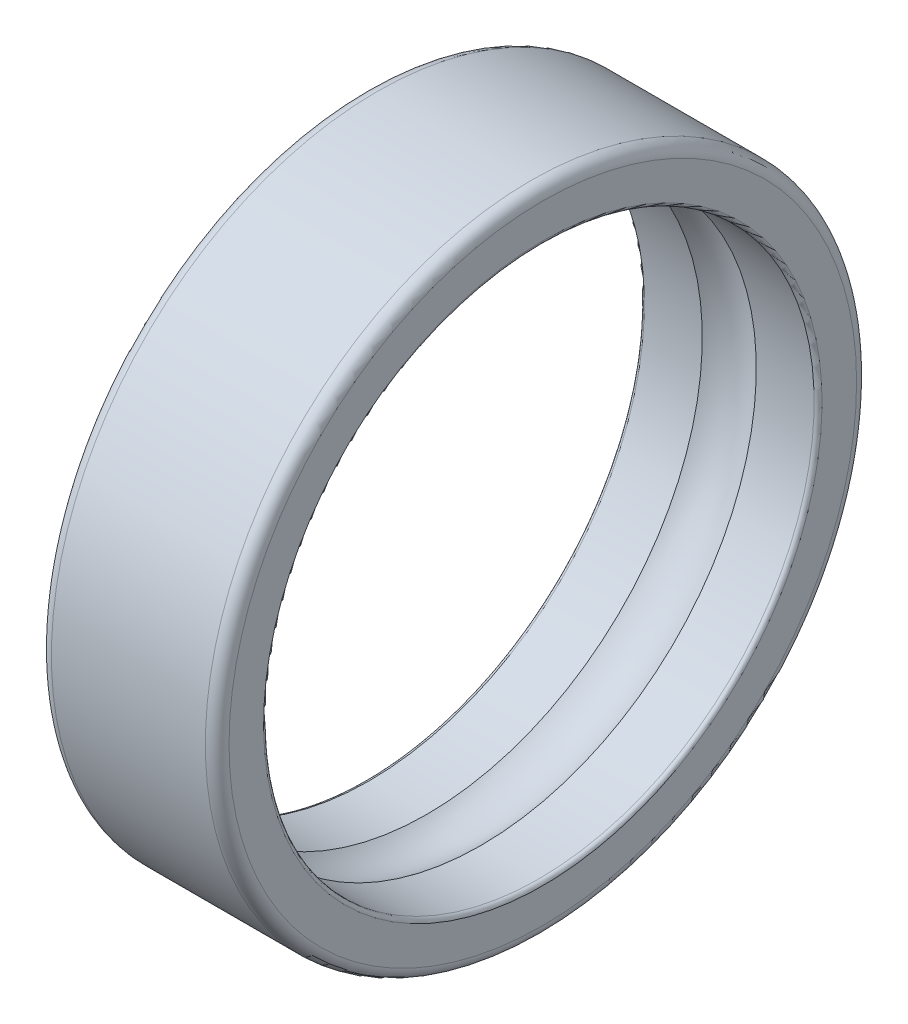
ISO-10303-21;
HEADER;
FILE_DESCRIPTION(('STEP AP214'),'2;1');
FILE_NAME('part.step','',(''),(''),'','','');
FILE_SCHEMA(('AUTOMOTIVE_DESIGN { 1 0 10303 214 1 1 1 1 }'));
ENDSEC;
DATA;
#1=APPLICATION_CONTEXT('core data for automotive mechanical design processes');
#2=APPLICATION_PROTOCOL_DEFINITION('international standard','automotive_design',2000,#1);
#3=PRODUCT_CONTEXT('',#1,'mechanical');
#4=PRODUCT('Part','Part','',(#3));
#5=PRODUCT_RELATED_PRODUCT_CATEGORY('part','',(#4));
#6=PRODUCT_DEFINITION_FORMATION('','',#4);
#7=PRODUCT_DEFINITION_CONTEXT('part definition',#1,'design');
#8=PRODUCT_DEFINITION('design','',#6,#7);
#9=PRODUCT_DEFINITION_SHAPE('','',#8);
#10=(LENGTH_UNIT() NAMED_UNIT(*) SI_UNIT(.MILLI.,.METRE.));
#11=(NAMED_UNIT(*) PLANE_ANGLE_UNIT() SI_UNIT($,.RADIAN.));
#12=(NAMED_UNIT(*) SI_UNIT($,.STERADIAN.) SOLID_ANGLE_UNIT());
#13=UNCERTAINTY_MEASURE_WITH_UNIT(LENGTH_MEASURE(1.E-05),#10,'distance_accuracy_value','');
#14=(GEOMETRIC_REPRESENTATION_CONTEXT(3) GLOBAL_UNCERTAINTY_ASSIGNED_CONTEXT((#13)) GLOBAL_UNIT_ASSIGNED_CONTEXT((#10,
#11,#12)) REPRESENTATION_CONTEXT('',''));
#15=CARTESIAN_POINT('',(0.,0.,0.));
#16=DIRECTION('',(0.,0.,1.));
#17=DIRECTION('',(1.,0.,0.));
#18=AXIS2_PLACEMENT_3D('',#15,#16,#17);
#19=CARTESIAN_POINT('',(0.,0.,0.));
#20=DIRECTION('',(1.,0.,0.));
#21=DIRECTION('',(0.,1.,0.));
#22=AXIS2_PLACEMENT_3D('',#19,#20,#21);
#23=TOROIDAL_SURFACE('',#22,4.,0.793999999999999);
#24=CARTESIAN_POINT('',(0.455999999999999,0.,0.));
#25=DIRECTION('',(-1.,0.,0.));
#26=DIRECTION('',(0.,-1.,0.));
#27=AXIS2_PLACEMENT_3D('',#24,#25,#26);
#28=CIRCLE('',#27,4.65);
#29=CARTESIAN_POINT('',(0.456000000000001,-4.65,0.));
#30=VERTEX_POINT('',#29);
#31=EDGE_CURVE('E135',#30,#30,#28,.F.);
#32=ORIENTED_EDGE('',*,*,#31,.T.);
#33=EDGE_LOOP('',(#32));
#34=FACE_BOUND('',#33,.T.);
#35=CARTESIAN_POINT('',(-0.456,0.,0.));
#36=DIRECTION('',(-1.,0.,0.));
#37=DIRECTION('',(0.,-1.,0.));
#38=AXIS2_PLACEMENT_3D('',#35,#36,#37);
#39=CIRCLE('',#38,4.65);
#40=CARTESIAN_POINT('',(-0.455999999999999,-4.65,0.));
#41=VERTEX_POINT('',#40);
#42=EDGE_CURVE('E142',#41,#41,#39,.T.);
#43=ORIENTED_EDGE('',*,*,#42,.T.);
#44=EDGE_LOOP('',(#43));
#45=FACE_BOUND('',#44,.T.);
#46=ADVANCED_FACE('F14',(#34,#45),#23,.F.);
#47=CARTESIAN_POINT('',(1.5,0.,0.));
#48=DIRECTION('',(-1.,0.,0.));
#49=DIRECTION('',(0.,-1.,0.));
#50=AXIS2_PLACEMENT_3D('',#47,#48,#49);
#51=CYLINDRICAL_SURFACE('',#50,4.65);
#52=CARTESIAN_POINT('',(-1.433333,0.,0.));
#53=DIRECTION('',(1.,0.,0.));
#54=DIRECTION('',(0.,1.,0.));
#55=AXIS2_PLACEMENT_3D('',#52,#53,#54);
#56=CIRCLE('',#55,4.65);
#57=CARTESIAN_POINT('',(-1.433333,4.65,0.));
#58=VERTEX_POINT('',#57);
#59=EDGE_CURVE('E108',#58,#58,#56,.T.);
#60=ORIENTED_EDGE('',*,*,#59,.F.);
#61=EDGE_LOOP('',(#60));
#62=FACE_BOUND('',#61,.T.);
#63=ORIENTED_EDGE('',*,*,#42,.F.);
#64=EDGE_LOOP('',(#63));
#65=FACE_BOUND('',#64,.T.);
#66=ADVANCED_FACE('F147',(#62,#65),#51,.F.);
#67=CARTESIAN_POINT('',(1.5,0.,0.));
#68=DIRECTION('',(-1.,0.,0.));
#69=DIRECTION('',(0.,-1.,0.));
#70=AXIS2_PLACEMENT_3D('',#67,#68,#69);
#71=CYLINDRICAL_SURFACE('',#70,4.65);
#72=ORIENTED_EDGE('',*,*,#31,.F.);
#73=EDGE_LOOP('',(#72));
#74=FACE_BOUND('',#73,.T.);
#75=CARTESIAN_POINT('',(1.433333,0.,0.));
#76=DIRECTION('',(1.,0.,0.));
#77=DIRECTION('',(0.,1.,0.));
#78=AXIS2_PLACEMENT_3D('',#75,#76,#77);
#79=CIRCLE('',#78,4.65);
#80=CARTESIAN_POINT('',(1.433333,4.65,0.));
#81=VERTEX_POINT('',#80);
#82=EDGE_CURVE('E105',#81,#81,#79,.F.);
#83=ORIENTED_EDGE('',*,*,#82,.F.);
#84=EDGE_LOOP('',(#83));
#85=FACE_BOUND('',#84,.T.);
#86=ADVANCED_FACE('F129',(#74,#85),#71,.F.);
#87=CARTESIAN_POINT('',(-1.433333,0.,0.));
#88=DIRECTION('',(1.,0.,0.));
#89=DIRECTION('',(0.,1.,0.));
#90=AXIS2_PLACEMENT_3D('',#87,#88,#89);
#91=TOROIDAL_SURFACE('',#90,4.716667,0.0666670000000009);
#92=CARTESIAN_POINT('',(-1.5,0.,0.));
#93=DIRECTION('',(-1.,0.,0.));
#94=DIRECTION('',(0.,1.,0.));
#95=AXIS2_PLACEMENT_3D('',#92,#93,#94);
#96=CIRCLE('',#95,4.716667);
#97=CARTESIAN_POINT('',(-1.5,4.716667,0.));
#98=VERTEX_POINT('',#97);
#99=EDGE_CURVE('E60',#98,#98,#96,.F.);
#100=ORIENTED_EDGE('',*,*,#99,.F.);
#101=EDGE_LOOP('',(#100));
#102=FACE_BOUND('',#101,.T.);
#103=ORIENTED_EDGE('',*,*,#59,.T.);
#104=EDGE_LOOP('',(#103));
#105=FACE_BOUND('',#104,.T.);
#106=ADVANCED_FACE('F125',(#102,#105),#91,.T.);
#107=CARTESIAN_POINT('',(1.433333,0.,0.));
#108=DIRECTION('',(1.,0.,0.));
#109=DIRECTION('',(0.,1.,0.));
#110=AXIS2_PLACEMENT_3D('',#107,#108,#109);
#111=TOROIDAL_SURFACE('',#110,4.716667,0.0666670000000003);
#112=ORIENTED_EDGE('',*,*,#82,.T.);
#113=EDGE_LOOP('',(#112));
#114=FACE_BOUND('',#113,.T.);
#115=CARTESIAN_POINT('',(1.5,0.,0.));
#116=DIRECTION('',(1.,0.,0.));
#117=DIRECTION('',(0.,1.,0.));
#118=AXIS2_PLACEMENT_3D('',#115,#116,#117);
#119=CIRCLE('',#118,4.716667);
#120=CARTESIAN_POINT('',(1.5,4.716667,0.));
#121=VERTEX_POINT('',#120);
#122=EDGE_CURVE('E113',#121,#121,#119,.F.);
#123=ORIENTED_EDGE('',*,*,#122,.F.);
#124=EDGE_LOOP('',(#123));
#125=FACE_BOUND('',#124,.T.);
#126=ADVANCED_FACE('F77',(#114,#125),#111,.T.);
#127=CARTESIAN_POINT('',(-1.5,5.3,0.));
#128=DIRECTION('',(-1.,0.,0.));
#129=DIRECTION('',(0.,-1.,0.));
#130=AXIS2_PLACEMENT_3D('',#127,#128,#129);
#131=PLANE('',#130);
#132=CARTESIAN_POINT('',(-1.5,0.,0.));
#133=DIRECTION('',(1.,0.,0.));
#134=DIRECTION('',(0.,1.,0.));
#135=AXIS2_PLACEMENT_3D('',#132,#133,#134);
#136=CIRCLE('',#135,5.3);
#137=CARTESIAN_POINT('',(-1.5,5.3,0.));
#138=VERTEX_POINT('',#137);
#139=EDGE_CURVE('E95',#138,#138,#136,.T.);
#140=ORIENTED_EDGE('',*,*,#139,.F.);
#141=EDGE_LOOP('',(#140));
#142=FACE_BOUND('',#141,.T.);
#143=ORIENTED_EDGE('',*,*,#99,.T.);
#144=EDGE_LOOP('',(#143));
#145=FACE_BOUND('',#144,.T.);
#146=ADVANCED_FACE('F67',(#142,#145),#131,.T.);
#147=CARTESIAN_POINT('',(1.5,4.716667,0.));
#148=DIRECTION('',(1.,0.,0.));
#149=DIRECTION('',(0.,0.,-1.));
#150=AXIS2_PLACEMENT_3D('',#147,#148,#149);
#151=PLANE('',#150);
#152=ORIENTED_EDGE('',*,*,#122,.T.);
#153=EDGE_LOOP('',(#152));
#154=FACE_BOUND('',#153,.T.);
#155=CARTESIAN_POINT('',(1.5,0.,0.));
#156=DIRECTION('',(-1.,0.,0.));
#157=DIRECTION('',(0.,1.,0.));
#158=AXIS2_PLACEMENT_3D('',#155,#156,#157);
#159=CIRCLE('',#158,5.3);
#160=CARTESIAN_POINT('',(1.5,5.3,0.));
#161=VERTEX_POINT('',#160);
#162=EDGE_CURVE('E26',#161,#161,#159,.T.);
#163=ORIENTED_EDGE('',*,*,#162,.F.);
#164=EDGE_LOOP('',(#163));
#165=FACE_BOUND('',#164,.T.);
#166=ADVANCED_FACE('F76',(#154,#165),#151,.T.);
#167=CARTESIAN_POINT('',(-1.3,0.,0.));
#168=DIRECTION('',(1.,0.,0.));
#169=DIRECTION('',(0.,1.,0.));
#170=AXIS2_PLACEMENT_3D('',#167,#168,#169);
#171=TOROIDAL_SURFACE('',#170,5.3,0.199999999999998);
#172=CARTESIAN_POINT('',(-1.3,0.,0.));
#173=DIRECTION('',(-1.,0.,0.));
#174=DIRECTION('',(0.,-1.,0.));
#175=AXIS2_PLACEMENT_3D('',#172,#173,#174);
#176=CIRCLE('',#175,5.5);
#177=CARTESIAN_POINT('',(-1.3,-5.5,0.));
#178=VERTEX_POINT('',#177);
#179=EDGE_CURVE('E21',#178,#178,#176,.F.);
#180=ORIENTED_EDGE('',*,*,#179,.F.);
#181=EDGE_LOOP('',(#180));
#182=FACE_BOUND('',#181,.T.);
#183=ORIENTED_EDGE('',*,*,#139,.T.);
#184=EDGE_LOOP('',(#183));
#185=FACE_BOUND('',#184,.T.);
#186=ADVANCED_FACE('F40',(#182,#185),#171,.T.);
#187=CARTESIAN_POINT('',(1.3,0.,0.));
#188=DIRECTION('',(1.,0.,0.));
#189=DIRECTION('',(0.,1.,0.));
#190=AXIS2_PLACEMENT_3D('',#187,#188,#189);
#191=TOROIDAL_SURFACE('',#190,5.3,0.199999999999999);
#192=ORIENTED_EDGE('',*,*,#162,.T.);
#193=EDGE_LOOP('',(#192));
#194=FACE_BOUND('',#193,.T.);
#195=CARTESIAN_POINT('',(1.3,0.,0.));
#196=DIRECTION('',(-1.,0.,0.));
#197=DIRECTION('',(0.,-1.,0.));
#198=AXIS2_PLACEMENT_3D('',#195,#196,#197);
#199=CIRCLE('',#198,5.5);
#200=CARTESIAN_POINT('',(1.3,-5.5,0.));
#201=VERTEX_POINT('',#200);
#202=EDGE_CURVE('E9',#201,#201,#199,.T.);
#203=ORIENTED_EDGE('',*,*,#202,.F.);
#204=EDGE_LOOP('',(#203));
#205=FACE_BOUND('',#204,.T.);
#206=ADVANCED_FACE('F34',(#194,#205),#191,.T.);
#207=CARTESIAN_POINT('',(1.5,0.,0.));
#208=DIRECTION('',(-1.,0.,0.));
#209=DIRECTION('',(0.,-1.,0.));
#210=AXIS2_PLACEMENT_3D('',#207,#208,#209);
#211=CYLINDRICAL_SURFACE('',#210,5.5);
#212=ORIENTED_EDGE('',*,*,#179,.T.);
#213=EDGE_LOOP('',(#212));
#214=FACE_BOUND('',#213,.T.);
#215=ORIENTED_EDGE('',*,*,#202,.T.);
#216=EDGE_LOOP('',(#215));
#217=FACE_BOUND('',#216,.T.);
#218=ADVANCED_FACE('F39',(#214,#217),#211,.T.);
#219=CLOSED_SHELL('',(#46,#66,#86,#106,#126,#146,#166,#186,#206,#218));
#220=MANIFOLD_SOLID_BREP('B1',#219);
#221=ADVANCED_BREP_SHAPE_REPRESENTATION('',(#18,#220),#14);
#222=SHAPE_DEFINITION_REPRESENTATION(#9,#221);
ENDSEC;
END-ISO-10303-21;
